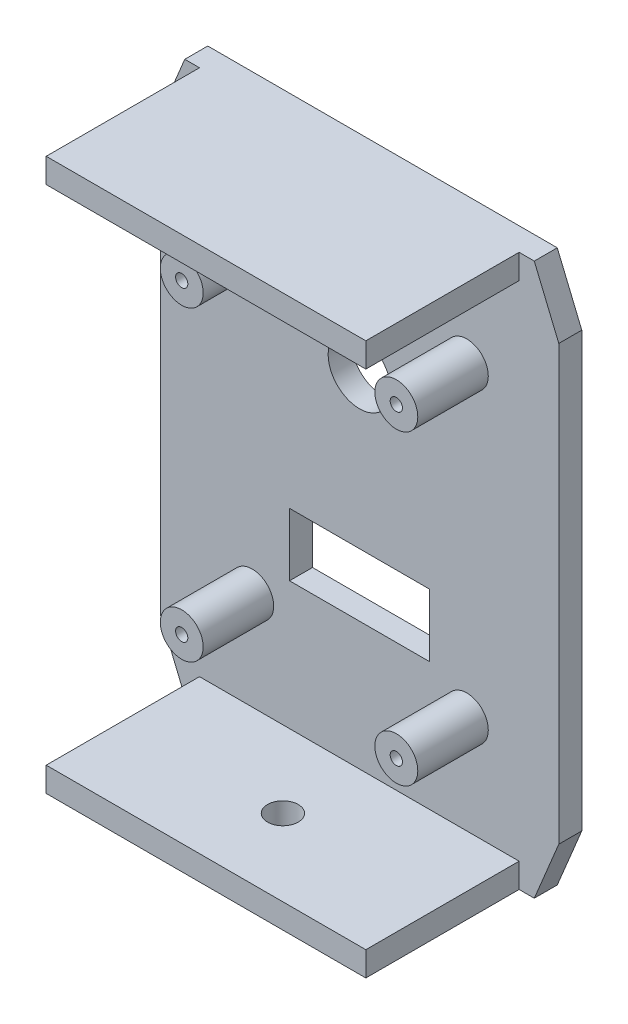
ISO-10303-21;
HEADER;
FILE_DESCRIPTION(('STEP AP214'),'2;1');
FILE_NAME('part.step','',(''),(''),'','','');
FILE_SCHEMA(('AUTOMOTIVE_DESIGN { 1 0 10303 214 1 1 1 1 }'));
ENDSEC;
DATA;
#1=APPLICATION_CONTEXT('core data for automotive mechanical design processes');
#2=APPLICATION_PROTOCOL_DEFINITION('international standard','automotive_design',2000,#1);
#3=PRODUCT_CONTEXT('',#1,'mechanical');
#4=PRODUCT('Part','Part','',(#3));
#5=PRODUCT_RELATED_PRODUCT_CATEGORY('part','',(#4));
#6=PRODUCT_DEFINITION_FORMATION('','',#4);
#7=PRODUCT_DEFINITION_CONTEXT('part definition',#1,'design');
#8=PRODUCT_DEFINITION('design','',#6,#7);
#9=PRODUCT_DEFINITION_SHAPE('','',#8);
#10=(LENGTH_UNIT() NAMED_UNIT(*) SI_UNIT(.MILLI.,.METRE.));
#11=(NAMED_UNIT(*) PLANE_ANGLE_UNIT() SI_UNIT($,.RADIAN.));
#12=(NAMED_UNIT(*) SI_UNIT($,.STERADIAN.) SOLID_ANGLE_UNIT());
#13=UNCERTAINTY_MEASURE_WITH_UNIT(LENGTH_MEASURE(1.E-05),#10,'distance_accuracy_value','');
#14=(GEOMETRIC_REPRESENTATION_CONTEXT(3) GLOBAL_UNCERTAINTY_ASSIGNED_CONTEXT((#13)) GLOBAL_UNIT_ASSIGNED_CONTEXT((#10,
#11,#12)) REPRESENTATION_CONTEXT('',''));
#15=CARTESIAN_POINT('',(0.,0.,0.));
#16=DIRECTION('',(0.,0.,1.));
#17=DIRECTION('',(1.,0.,0.));
#18=AXIS2_PLACEMENT_3D('',#15,#16,#17);
#19=CARTESIAN_POINT('',(0.,0.,4.7625));
#20=DIRECTION('',(0.,0.,1.));
#21=DIRECTION('',(1.,0.,0.));
#22=AXIS2_PLACEMENT_3D('',#19,#20,#21);
#23=PLANE('',#22);
#24=CARTESIAN_POINT('',(-33.2771901818714,22.9491818922137,4.7625));
#25=DIRECTION('',(0.,0.,1.));
#26=DIRECTION('',(1.,0.,0.));
#27=AXIS2_PLACEMENT_3D('',#24,#25,#26);
#28=CIRCLE('',#27,4.44499999999999);
#29=CARTESIAN_POINT('',(-28.8321901818714,22.9491818922137,4.7625));
#30=VERTEX_POINT('',#29);
#31=EDGE_CURVE('E543',#30,#30,#28,.T.);
#32=ORIENTED_EDGE('',*,*,#31,.F.);
#33=EDGE_LOOP('',(#32));
#34=FACE_BOUND('',#33,.T.);
#35=CARTESIAN_POINT('',(11.1728098181286,22.9491818922137,4.7625));
#36=DIRECTION('',(0.,0.,1.));
#37=DIRECTION('',(1.,0.,0.));
#38=AXIS2_PLACEMENT_3D('',#35,#36,#37);
#39=CIRCLE('',#38,4.445);
#40=CARTESIAN_POINT('',(15.6178098181286,22.9491818922137,4.7625));
#41=VERTEX_POINT('',#40);
#42=EDGE_CURVE('E547',#41,#41,#39,.T.);
#43=ORIENTED_EDGE('',*,*,#42,.F.);
#44=EDGE_LOOP('',(#43));
#45=FACE_BOUND('',#44,.T.);
#46=CARTESIAN_POINT('',(-33.2771901818714,-40.5508181077864,4.7625));
#47=DIRECTION('',(0.,0.,1.));
#48=DIRECTION('',(1.,0.,0.));
#49=AXIS2_PLACEMENT_3D('',#46,#47,#48);
#50=CIRCLE('',#49,4.445);
#51=CARTESIAN_POINT('',(-28.8321901818714,-40.5508181077864,4.7625));
#52=VERTEX_POINT('',#51);
#53=EDGE_CURVE('E553',#52,#52,#50,.T.);
#54=ORIENTED_EDGE('',*,*,#53,.F.);
#55=EDGE_LOOP('',(#54));
#56=FACE_BOUND('',#55,.T.);
#57=CARTESIAN_POINT('',(11.1728098181286,-40.5508181077864,4.7625));
#58=DIRECTION('',(0.,0.,1.));
#59=DIRECTION('',(1.,0.,0.));
#60=AXIS2_PLACEMENT_3D('',#57,#58,#59);
#61=CIRCLE('',#60,4.445);
#62=CARTESIAN_POINT('',(15.6178098181286,-40.5508181077864,4.7625));
#63=VERTEX_POINT('',#62);
#64=EDGE_CURVE('E559',#63,#63,#61,.T.);
#65=ORIENTED_EDGE('',*,*,#64,.F.);
#66=EDGE_LOOP('',(#65));
#67=FACE_BOUND('',#66,.T.);
#68=CARTESIAN_POINT('',(-11.0521901818713,10.2491818922136,4.7625));
#69=DIRECTION('',(0.,0.,-1.));
#70=DIRECTION('',(-1.,0.,0.));
#71=AXIS2_PLACEMENT_3D('',#68,#69,#70);
#72=CIRCLE('',#71,6.4999997);
#73=CARTESIAN_POINT('',(-17.5521898818713,10.2491818922136,4.7625));
#74=VERTEX_POINT('',#73);
#75=EDGE_CURVE('E203',#74,#74,#72,.T.);
#76=ORIENTED_EDGE('',*,*,#75,.T.);
#77=EDGE_LOOP('',(#76));
#78=FACE_BOUND('',#77,.T.);
#79=DIRECTION('',(0.,1.,0.));
#80=VECTOR('',#79,1.);
#81=CARTESIAN_POINT('',(-25.5521611818713,-21.3508184077864,4.7625));
#82=LINE('',#81,#80);
#83=CARTESIAN_POINT('',(-25.5521611818713,-34.3508178077864,4.7625));
#84=VERTEX_POINT('',#83);
#85=CARTESIAN_POINT('',(-25.5521611818713,-21.3508184077864,4.7625));
#86=VERTEX_POINT('',#85);
#87=EDGE_CURVE('E175',#84,#86,#82,.T.);
#88=ORIENTED_EDGE('',*,*,#87,.T.);
#89=DIRECTION('',(1.,0.,0.));
#90=VECTOR('',#89,1.);
#91=CARTESIAN_POINT('',(3.44778081812867,-21.3508184077864,4.7625));
#92=LINE('',#91,#90);
#93=CARTESIAN_POINT('',(3.44778081812867,-21.3508184077864,4.7625));
#94=VERTEX_POINT('',#93);
#95=EDGE_CURVE('E184',#86,#94,#92,.T.);
#96=ORIENTED_EDGE('',*,*,#95,.T.);
#97=DIRECTION('',(0.,-1.,0.));
#98=VECTOR('',#97,1.);
#99=CARTESIAN_POINT('',(3.44778081812867,-21.3508184077864,4.7625));
#100=LINE('',#99,#98);
#101=CARTESIAN_POINT('',(3.44778081812867,-34.3508178077864,4.7625));
#102=VERTEX_POINT('',#101);
#103=EDGE_CURVE('E52',#94,#102,#100,.T.);
#104=ORIENTED_EDGE('',*,*,#103,.T.);
#105=DIRECTION('',(-1.,0.,0.));
#106=VECTOR('',#105,1.);
#107=CARTESIAN_POINT('',(3.44778081812867,-34.3508178077864,4.7625));
#108=LINE('',#107,#106);
#109=EDGE_CURVE('E181',#102,#84,#108,.T.);
#110=ORIENTED_EDGE('',*,*,#109,.T.);
#111=EDGE_LOOP('',(#88,#96,#104,#110));
#112=FACE_BOUND('',#111,.T.);
#113=DIRECTION('',(1.,0.,0.));
#114=VECTOR('',#113,1.);
#115=CARTESIAN_POINT('',(0.,-65.9508181077864,4.7625));
#116=LINE('',#115,#114);
#117=CARTESIAN_POINT('',(-47.2471901818713,-65.9508181077864,4.7625));
#118=VERTEX_POINT('',#117);
#119=CARTESIAN_POINT('',(-44.1991901818713,-65.9508181077865,4.7625));
#120=VERTEX_POINT('',#119);
#121=EDGE_CURVE('E274',#118,#120,#116,.T.);
#122=ORIENTED_EDGE('',*,*,#121,.T.);
#123=DIRECTION('',(0.,-1.,0.));
#124=VECTOR('',#123,1.);
#125=CARTESIAN_POINT('',(-44.1991901818713,-60.8709997598715,4.7625));
#126=LINE('',#125,#124);
#127=CARTESIAN_POINT('',(-44.1991901818713,-60.8709997598715,4.7625));
#128=VERTEX_POINT('',#127);
#129=EDGE_CURVE('E226',#128,#120,#126,.T.);
#130=ORIENTED_EDGE('',*,*,#129,.F.);
#131=DIRECTION('',(-1.,0.,0.));
#132=VECTOR('',#131,1.);
#133=CARTESIAN_POINT('',(-44.1991901818713,-60.8709997598715,4.7625));
#134=LINE('',#133,#132);
#135=CARTESIAN_POINT('',(22.0016687501231,-60.8709997598715,4.7625));
#136=VERTEX_POINT('',#135);
#137=EDGE_CURVE('E209',#136,#128,#134,.T.);
#138=ORIENTED_EDGE('',*,*,#137,.F.);
#139=DIRECTION('',(0.,1.,0.));
#140=VECTOR('',#139,1.);
#141=CARTESIAN_POINT('',(22.0016687501231,-60.8709997598715,4.7625));
#142=LINE('',#141,#140);
#143=CARTESIAN_POINT('',(22.0016687501231,-65.9508181077864,4.7625));
#144=VERTEX_POINT('',#143);
#145=EDGE_CURVE('E217',#144,#136,#142,.T.);
#146=ORIENTED_EDGE('',*,*,#145,.F.);
#147=CARTESIAN_POINT('',(25.1428098181287,-65.9508181077864,4.7625));
#148=VERTEX_POINT('',#147);
#149=EDGE_CURVE('E272',#144,#148,#116,.T.);
#150=ORIENTED_EDGE('',*,*,#149,.T.);
#151=DIRECTION('',(0.383447283100766,0.923562765101886,0.));
#152=VECTOR('',#151,1.);
#153=CARTESIAN_POINT('',(44.8016833803675,-18.6008839027281,4.7625));
#154=LINE('',#153,#152);
#155=CARTESIAN_POINT('',(30.2228098181286,-53.7152408759492,4.7625));
#156=VERTEX_POINT('',#155);
#157=EDGE_CURVE('E277',#148,#156,#154,.T.);
#158=ORIENTED_EDGE('',*,*,#157,.T.);
#159=DIRECTION('',(0.,-1.,0.));
#160=VECTOR('',#159,1.);
#161=CARTESIAN_POINT('',(30.2228098181286,0.,4.7625));
#162=LINE('',#161,#160);
#163=CARTESIAN_POINT('',(30.2228098181286,36.1136046603764,4.7625));
#164=VERTEX_POINT('',#163);
#165=EDGE_CURVE('E279',#164,#156,#162,.T.);
#166=ORIENTED_EDGE('',*,*,#165,.F.);
#167=DIRECTION('',(0.383447283100766,-0.923562765101886,0.));
#168=VECTOR('',#167,1.);
#169=CARTESIAN_POINT('',(38.5682815931536,16.0128833140307,4.7625));
#170=LINE('',#169,#168);
#171=CARTESIAN_POINT('',(25.1428098181286,48.3491818922136,4.7625));
#172=VERTEX_POINT('',#171);
#173=EDGE_CURVE('E282',#172,#164,#170,.T.);
#174=ORIENTED_EDGE('',*,*,#173,.F.);
#175=DIRECTION('',(1.,0.,0.));
#176=VECTOR('',#175,1.);
#177=CARTESIAN_POINT('',(0.,48.3491818922136,4.7625));
#178=LINE('',#177,#176);
#179=CARTESIAN_POINT('',(22.0016687501231,48.3491818922136,4.7625));
#180=VERTEX_POINT('',#179);
#181=EDGE_CURVE('E285',#180,#172,#178,.T.);
#182=ORIENTED_EDGE('',*,*,#181,.F.);
#183=DIRECTION('',(0.,1.,0.));
#184=VECTOR('',#183,1.);
#185=CARTESIAN_POINT('',(22.0016687501231,43.2693635442985,4.7625));
#186=LINE('',#185,#184);
#187=CARTESIAN_POINT('',(22.0016687501231,43.2693635442985,4.7625));
#188=VERTEX_POINT('',#187);
#189=EDGE_CURVE('E243',#188,#180,#186,.T.);
#190=ORIENTED_EDGE('',*,*,#189,.F.);
#191=DIRECTION('',(1.,0.,0.));
#192=VECTOR('',#191,1.);
#193=CARTESIAN_POINT('',(-44.1991901818713,43.2693635442985,4.7625));
#194=LINE('',#193,#192);
#195=CARTESIAN_POINT('',(-44.1991901818713,43.2693635442985,4.7625));
#196=VERTEX_POINT('',#195);
#197=EDGE_CURVE('E252',#196,#188,#194,.T.);
#198=ORIENTED_EDGE('',*,*,#197,.F.);
#199=DIRECTION('',(0.,-1.,0.));
#200=VECTOR('',#199,1.);
#201=CARTESIAN_POINT('',(-44.1991901818713,43.2693635442985,4.7625));
#202=LINE('',#201,#200);
#203=CARTESIAN_POINT('',(-44.1991901818713,48.3491818922136,4.7625));
#204=VERTEX_POINT('',#203);
#205=EDGE_CURVE('E238',#204,#196,#202,.T.);
#206=ORIENTED_EDGE('',*,*,#205,.F.);
#207=CARTESIAN_POINT('',(-47.2471901818713,48.3491818922136,4.7625));
#208=VERTEX_POINT('',#207);
#209=EDGE_CURVE('E286',#208,#204,#178,.T.);
#210=ORIENTED_EDGE('',*,*,#209,.F.);
#211=DIRECTION('',(-0.383447283100767,-0.923562765101886,0.));
#212=VECTOR('',#211,1.);
#213=CARTESIAN_POINT('',(-57.4226147059741,23.8408762561133,4.7625));
#214=LINE('',#213,#212);
#215=CARTESIAN_POINT('',(-52.3271901818714,36.1136046603762,4.7625));
#216=VERTEX_POINT('',#215);
#217=EDGE_CURVE('E289',#208,#216,#214,.T.);
#218=ORIENTED_EDGE('',*,*,#217,.T.);
#219=DIRECTION('',(0.,-1.,0.));
#220=VECTOR('',#219,1.);
#221=CARTESIAN_POINT('',(-52.3271901818714,0.,4.7625));
#222=LINE('',#221,#220);
#223=CARTESIAN_POINT('',(-52.3271901818714,-53.7152408759491,4.7625));
#224=VERTEX_POINT('',#223);
#225=EDGE_CURVE('E291',#216,#224,#222,.T.);
#226=ORIENTED_EDGE('',*,*,#225,.T.);
#227=DIRECTION('',(-0.383447283100767,0.923562765101886,0.));
#228=VECTOR('',#227,1.);
#229=CARTESIAN_POINT('',(-63.6560164931879,-26.4288768448106,4.7625));
#230=LINE('',#229,#228);
#231=EDGE_CURVE('E269',#118,#224,#230,.T.);
#232=ORIENTED_EDGE('',*,*,#231,.F.);
#233=EDGE_LOOP('',(#122,#130,#138,#146,#150,#158,#166,#174,#182,#190,#198,#206,#210,#218,#226,#232));
#234=FACE_BOUND('',#233,.T.);
#235=ADVANCED_FACE('F36',(#34,#45,#56,#67,#78,#112,#234),#23,.T.);
#236=CARTESIAN_POINT('',(-63.6560164931879,-26.4288768448106,4.7625));
#237=DIRECTION('',(-0.923562765101886,-0.383447283100766,0.));
#238=DIRECTION('',(0.383447283100767,-0.923562765101886,0.));
#239=AXIS2_PLACEMENT_3D('',#236,#237,#238);
#240=PLANE('',#239);
#241=DIRECTION('',(-0.383447283100767,0.923562765101886,0.));
#242=VECTOR('',#241,1.);
#243=CARTESIAN_POINT('',(-63.6560164931879,-26.4288768448106,0.));
#244=LINE('',#243,#242);
#245=CARTESIAN_POINT('',(-47.2471901818713,-65.9508181077864,0.));
#246=VERTEX_POINT('',#245);
#247=CARTESIAN_POINT('',(-52.3271901818714,-53.7152408759491,0.));
#248=VERTEX_POINT('',#247);
#249=EDGE_CURVE('E268',#246,#248,#244,.T.);
#250=ORIENTED_EDGE('',*,*,#249,.F.);
#251=DIRECTION('',(0.,0.,-1.));
#252=VECTOR('',#251,1.);
#253=CARTESIAN_POINT('',(-47.2471901818713,-65.9508181077864,4.7625));
#254=LINE('',#253,#252);
#255=EDGE_CURVE('E11',#118,#246,#254,.T.);
#256=ORIENTED_EDGE('',*,*,#255,.F.);
#257=ORIENTED_EDGE('',*,*,#231,.T.);
#258=DIRECTION('',(0.,0.,-1.));
#259=VECTOR('',#258,1.);
#260=CARTESIAN_POINT('',(-52.3271901818714,-53.7152408759491,4.7625));
#261=LINE('',#260,#259);
#262=EDGE_CURVE('E293',#224,#248,#261,.T.);
#263=ORIENTED_EDGE('',*,*,#262,.T.);
#264=EDGE_LOOP('',(#250,#256,#257,#263));
#265=FACE_BOUND('',#264,.T.);
#266=ADVANCED_FACE('F38',(#265),#240,.T.);
#267=CARTESIAN_POINT('',(0.,-65.9508181077864,4.7625));
#268=DIRECTION('',(0.,1.,0.));
#269=DIRECTION('',(0.,0.,1.));
#270=AXIS2_PLACEMENT_3D('',#267,#268,#269);
#271=PLANE('',#270);
#272=CARTESIAN_POINT('',(-11.0521901818713,-65.9508181077864,20.6375));
#273=DIRECTION('',(0.,-1.,0.));
#274=DIRECTION('',(0.,0.,-1.));
#275=AXIS2_PLACEMENT_3D('',#272,#273,#274);
#276=CIRCLE('',#275,3.175);
#277=CARTESIAN_POINT('',(-11.0521901818713,-65.9508181077864,17.4625));
#278=VERTEX_POINT('',#277);
#279=EDGE_CURVE('E416',#278,#278,#276,.T.);
#280=ORIENTED_EDGE('',*,*,#279,.F.);
#281=EDGE_LOOP('',(#280));
#282=FACE_BOUND('',#281,.T.);
#283=DIRECTION('',(1.,0.,0.));
#284=VECTOR('',#283,1.);
#285=CARTESIAN_POINT('',(0.,-65.9508181077864,0.));
#286=LINE('',#285,#284);
#287=CARTESIAN_POINT('',(25.1428098181287,-65.9508181077864,0.));
#288=VERTEX_POINT('',#287);
#289=EDGE_CURVE('E296',#246,#288,#286,.T.);
#290=ORIENTED_EDGE('',*,*,#289,.T.);
#291=DIRECTION('',(0.,0.,-1.));
#292=VECTOR('',#291,1.);
#293=CARTESIAN_POINT('',(25.1428098181287,-65.9508181077864,4.7625));
#294=LINE('',#293,#292);
#295=EDGE_CURVE('E45',#148,#288,#294,.T.);
#296=ORIENTED_EDGE('',*,*,#295,.F.);
#297=ORIENTED_EDGE('',*,*,#149,.F.);
#298=DIRECTION('',(0.,0.,-1.));
#299=VECTOR('',#298,1.);
#300=CARTESIAN_POINT('',(22.0016687501231,-65.9508181077865,36.5125));
#301=LINE('',#300,#299);
#302=CARTESIAN_POINT('',(22.0016687501231,-65.9508181077865,36.5125));
#303=VERTEX_POINT('',#302);
#304=EDGE_CURVE('E231',#303,#144,#301,.T.);
#305=ORIENTED_EDGE('',*,*,#304,.F.);
#306=DIRECTION('',(1.,0.,0.));
#307=VECTOR('',#306,1.);
#308=CARTESIAN_POINT('',(-44.1991901818713,-65.9508181077865,36.5125));
#309=LINE('',#308,#307);
#310=CARTESIAN_POINT('',(-44.1991901818713,-65.9508181077865,36.5125));
#311=VERTEX_POINT('',#310);
#312=EDGE_CURVE('E219',#311,#303,#309,.T.);
#313=ORIENTED_EDGE('',*,*,#312,.F.);
#314=DIRECTION('',(0.,0.,-1.));
#315=VECTOR('',#314,1.);
#316=CARTESIAN_POINT('',(-44.1991901818713,-65.9508181077865,36.5125));
#317=LINE('',#316,#315);
#318=EDGE_CURVE('E233',#311,#120,#317,.T.);
#319=ORIENTED_EDGE('',*,*,#318,.T.);
#320=ORIENTED_EDGE('',*,*,#121,.F.);
#321=ORIENTED_EDGE('',*,*,#255,.T.);
#322=EDGE_LOOP('',(#290,#296,#297,#305,#313,#319,#320,#321));
#323=FACE_BOUND('',#322,.T.);
#324=ADVANCED_FACE('F385',(#282,#323),#271,.F.);
#325=CARTESIAN_POINT('',(44.8016833803675,-18.6008839027281,4.7625));
#326=DIRECTION('',(-0.923562765101886,0.383447283100766,0.));
#327=DIRECTION('',(-0.383447283100766,-0.923562765101886,0.));
#328=AXIS2_PLACEMENT_3D('',#325,#326,#327);
#329=PLANE('',#328);
#330=DIRECTION('',(0.383447283100766,0.923562765101886,0.));
#331=VECTOR('',#330,1.);
#332=CARTESIAN_POINT('',(44.8016833803675,-18.6008839027281,0.));
#333=LINE('',#332,#331);
#334=CARTESIAN_POINT('',(30.2228098181286,-53.7152408759492,0.));
#335=VERTEX_POINT('',#334);
#336=EDGE_CURVE('E298',#288,#335,#333,.T.);
#337=ORIENTED_EDGE('',*,*,#336,.T.);
#338=DIRECTION('',(0.,0.,-1.));
#339=VECTOR('',#338,1.);
#340=CARTESIAN_POINT('',(30.2228098181286,-53.7152408759492,4.7625));
#341=LINE('',#340,#339);
#342=EDGE_CURVE('E324',#156,#335,#341,.T.);
#343=ORIENTED_EDGE('',*,*,#342,.F.);
#344=ORIENTED_EDGE('',*,*,#157,.F.);
#345=ORIENTED_EDGE('',*,*,#295,.T.);
#346=EDGE_LOOP('',(#337,#343,#344,#345));
#347=FACE_BOUND('',#346,.T.);
#348=ADVANCED_FACE('F331',(#347),#329,.F.);
#349=CARTESIAN_POINT('',(30.2228098181286,0.,4.7625));
#350=DIRECTION('',(1.,0.,0.));
#351=DIRECTION('',(0.,1.,0.));
#352=AXIS2_PLACEMENT_3D('',#349,#350,#351);
#353=PLANE('',#352);
#354=DIRECTION('',(0.,-1.,0.));
#355=VECTOR('',#354,1.);
#356=CARTESIAN_POINT('',(30.2228098181286,0.,0.));
#357=LINE('',#356,#355);
#358=CARTESIAN_POINT('',(30.2228098181286,36.1136046603764,0.));
#359=VERTEX_POINT('',#358);
#360=EDGE_CURVE('E301',#359,#335,#357,.T.);
#361=ORIENTED_EDGE('',*,*,#360,.F.);
#362=DIRECTION('',(0.,0.,-1.));
#363=VECTOR('',#362,1.);
#364=CARTESIAN_POINT('',(30.2228098181286,36.1136046603764,4.7625));
#365=LINE('',#364,#363);
#366=EDGE_CURVE('E322',#164,#359,#365,.T.);
#367=ORIENTED_EDGE('',*,*,#366,.F.);
#368=ORIENTED_EDGE('',*,*,#165,.T.);
#369=ORIENTED_EDGE('',*,*,#342,.T.);
#370=EDGE_LOOP('',(#361,#367,#368,#369));
#371=FACE_BOUND('',#370,.T.);
#372=ADVANCED_FACE('F342',(#371),#353,.T.);
#373=CARTESIAN_POINT('',(38.5682815931536,16.0128833140307,4.7625));
#374=DIRECTION('',(0.923562765101886,0.383447283100766,0.));
#375=DIRECTION('',(-0.383447283100766,0.923562765101886,0.));
#376=AXIS2_PLACEMENT_3D('',#373,#374,#375);
#377=PLANE('',#376);
#378=DIRECTION('',(0.383447283100766,-0.923562765101886,0.));
#379=VECTOR('',#378,1.);
#380=CARTESIAN_POINT('',(38.5682815931536,16.0128833140307,0.));
#381=LINE('',#380,#379);
#382=CARTESIAN_POINT('',(25.1428098181286,48.3491818922136,0.));
#383=VERTEX_POINT('',#382);
#384=EDGE_CURVE('E304',#383,#359,#381,.T.);
#385=ORIENTED_EDGE('',*,*,#384,.F.);
#386=DIRECTION('',(0.,0.,-1.));
#387=VECTOR('',#386,1.);
#388=CARTESIAN_POINT('',(25.1428098181286,48.3491818922136,4.7625));
#389=LINE('',#388,#387);
#390=EDGE_CURVE('E320',#172,#383,#389,.T.);
#391=ORIENTED_EDGE('',*,*,#390,.F.);
#392=ORIENTED_EDGE('',*,*,#173,.T.);
#393=ORIENTED_EDGE('',*,*,#366,.T.);
#394=EDGE_LOOP('',(#385,#391,#392,#393));
#395=FACE_BOUND('',#394,.T.);
#396=ADVANCED_FACE('F347',(#395),#377,.T.);
#397=CARTESIAN_POINT('',(0.,48.3491818922136,4.7625));
#398=DIRECTION('',(0.,1.,0.));
#399=DIRECTION('',(0.,0.,1.));
#400=AXIS2_PLACEMENT_3D('',#397,#398,#399);
#401=PLANE('',#400);
#402=DIRECTION('',(1.,0.,0.));
#403=VECTOR('',#402,1.);
#404=CARTESIAN_POINT('',(0.,48.3491818922136,0.));
#405=LINE('',#404,#403);
#406=CARTESIAN_POINT('',(-47.2471901818713,48.3491818922136,0.));
#407=VERTEX_POINT('',#406);
#408=EDGE_CURVE('E307',#407,#383,#405,.T.);
#409=ORIENTED_EDGE('',*,*,#408,.F.);
#410=DIRECTION('',(0.,0.,-1.));
#411=VECTOR('',#410,1.);
#412=CARTESIAN_POINT('',(-47.2471901818713,48.3491818922136,4.7625));
#413=LINE('',#412,#411);
#414=EDGE_CURVE('E318',#208,#407,#413,.T.);
#415=ORIENTED_EDGE('',*,*,#414,.F.);
#416=ORIENTED_EDGE('',*,*,#209,.T.);
#417=DIRECTION('',(0.,0.,-1.));
#418=VECTOR('',#417,1.);
#419=CARTESIAN_POINT('',(-44.1991901818713,48.3491818922136,36.5125));
#420=LINE('',#419,#418);
#421=CARTESIAN_POINT('',(-44.1991901818713,48.3491818922136,36.5125));
#422=VERTEX_POINT('',#421);
#423=EDGE_CURVE('E249',#422,#204,#420,.T.);
#424=ORIENTED_EDGE('',*,*,#423,.F.);
#425=DIRECTION('',(-1.,0.,0.));
#426=VECTOR('',#425,1.);
#427=CARTESIAN_POINT('',(-44.1991901818713,48.3491818922136,36.5125));
#428=LINE('',#427,#426);
#429=CARTESIAN_POINT('',(22.0016687501231,48.3491818922136,36.5125));
#430=VERTEX_POINT('',#429);
#431=EDGE_CURVE('E247',#430,#422,#428,.T.);
#432=ORIENTED_EDGE('',*,*,#431,.F.);
#433=DIRECTION('',(0.,0.,-1.));
#434=VECTOR('',#433,1.);
#435=CARTESIAN_POINT('',(22.0016687501231,48.3491818922136,36.5125));
#436=LINE('',#435,#434);
#437=EDGE_CURVE('E259',#430,#180,#436,.T.);
#438=ORIENTED_EDGE('',*,*,#437,.T.);
#439=ORIENTED_EDGE('',*,*,#181,.T.);
#440=ORIENTED_EDGE('',*,*,#390,.T.);
#441=EDGE_LOOP('',(#409,#415,#416,#424,#432,#438,#439,#440));
#442=FACE_BOUND('',#441,.T.);
#443=ADVANCED_FACE('F350',(#442),#401,.T.);
#444=CARTESIAN_POINT('',(-57.4226147059741,23.8408762561133,4.7625));
#445=DIRECTION('',(0.923562765101886,-0.383447283100766,0.));
#446=DIRECTION('',(0.383447283100767,0.923562765101886,0.));
#447=AXIS2_PLACEMENT_3D('',#444,#445,#446);
#448=PLANE('',#447);
#449=DIRECTION('',(-0.383447283100767,-0.923562765101886,0.));
#450=VECTOR('',#449,1.);
#451=CARTESIAN_POINT('',(-57.4226147059741,23.8408762561133,0.));
#452=LINE('',#451,#450);
#453=CARTESIAN_POINT('',(-52.3271901818714,36.1136046603762,0.));
#454=VERTEX_POINT('',#453);
#455=EDGE_CURVE('E310',#407,#454,#452,.T.);
#456=ORIENTED_EDGE('',*,*,#455,.T.);
#457=DIRECTION('',(0.,0.,-1.));
#458=VECTOR('',#457,1.);
#459=CARTESIAN_POINT('',(-52.3271901818714,36.1136046603762,4.7625));
#460=LINE('',#459,#458);
#461=EDGE_CURVE('E315',#216,#454,#460,.T.);
#462=ORIENTED_EDGE('',*,*,#461,.F.);
#463=ORIENTED_EDGE('',*,*,#217,.F.);
#464=ORIENTED_EDGE('',*,*,#414,.T.);
#465=EDGE_LOOP('',(#456,#462,#463,#464));
#466=FACE_BOUND('',#465,.T.);
#467=ADVANCED_FACE('F398',(#466),#448,.F.);
#468=CARTESIAN_POINT('',(-52.3271901818714,0.,4.7625));
#469=DIRECTION('',(1.,0.,0.));
#470=DIRECTION('',(0.,1.,0.));
#471=AXIS2_PLACEMENT_3D('',#468,#469,#470);
#472=PLANE('',#471);
#473=DIRECTION('',(0.,-1.,0.));
#474=VECTOR('',#473,1.);
#475=CARTESIAN_POINT('',(-52.3271901818714,0.,0.));
#476=LINE('',#475,#474);
#477=EDGE_CURVE('E273',#454,#248,#476,.T.);
#478=ORIENTED_EDGE('',*,*,#477,.T.);
#479=ORIENTED_EDGE('',*,*,#262,.F.);
#480=ORIENTED_EDGE('',*,*,#225,.F.);
#481=ORIENTED_EDGE('',*,*,#461,.T.);
#482=EDGE_LOOP('',(#478,#479,#480,#481));
#483=FACE_BOUND('',#482,.T.);
#484=ADVANCED_FACE('F394',(#483),#472,.F.);
#485=CARTESIAN_POINT('',(0.,0.,0.));
#486=DIRECTION('',(0.,0.,1.));
#487=DIRECTION('',(1.,0.,0.));
#488=AXIS2_PLACEMENT_3D('',#485,#486,#487);
#489=PLANE('',#488);
#490=CARTESIAN_POINT('',(11.1728098181286,22.9491818922137,0.));
#491=DIRECTION('',(0.,0.,1.));
#492=DIRECTION('',(1.,0.,0.));
#493=AXIS2_PLACEMENT_3D('',#490,#491,#492);
#494=CIRCLE('',#493,1.27);
#495=CARTESIAN_POINT('',(12.4428098181286,22.9491818922137,0.));
#496=VERTEX_POINT('',#495);
#497=EDGE_CURVE('E523',#496,#496,#494,.T.);
#498=ORIENTED_EDGE('',*,*,#497,.T.);
#499=EDGE_LOOP('',(#498));
#500=FACE_BOUND('',#499,.T.);
#501=CARTESIAN_POINT('',(11.1728098181286,-40.5508181077864,0.));
#502=DIRECTION('',(0.,0.,1.));
#503=DIRECTION('',(1.,0.,0.));
#504=AXIS2_PLACEMENT_3D('',#501,#502,#503);
#505=CIRCLE('',#504,1.27);
#506=CARTESIAN_POINT('',(12.4428098181286,-40.5508181077864,0.));
#507=VERTEX_POINT('',#506);
#508=EDGE_CURVE('E527',#507,#507,#505,.T.);
#509=ORIENTED_EDGE('',*,*,#508,.T.);
#510=EDGE_LOOP('',(#509));
#511=FACE_BOUND('',#510,.T.);
#512=CARTESIAN_POINT('',(-33.2771901818714,-40.5508181077864,0.));
#513=DIRECTION('',(0.,0.,1.));
#514=DIRECTION('',(1.,0.,0.));
#515=AXIS2_PLACEMENT_3D('',#512,#513,#514);
#516=CIRCLE('',#515,1.27);
#517=CARTESIAN_POINT('',(-32.0071901818714,-40.5508181077864,0.));
#518=VERTEX_POINT('',#517);
#519=EDGE_CURVE('E524',#518,#518,#516,.T.);
#520=ORIENTED_EDGE('',*,*,#519,.T.);
#521=EDGE_LOOP('',(#520));
#522=FACE_BOUND('',#521,.T.);
#523=CARTESIAN_POINT('',(-33.2771901818714,22.9491818922137,0.));
#524=DIRECTION('',(0.,0.,1.));
#525=DIRECTION('',(1.,0.,0.));
#526=AXIS2_PLACEMENT_3D('',#523,#524,#525);
#527=CIRCLE('',#526,1.27);
#528=CARTESIAN_POINT('',(-32.0071901818714,22.9491818922137,0.));
#529=VERTEX_POINT('',#528);
#530=EDGE_CURVE('E540',#529,#529,#527,.T.);
#531=ORIENTED_EDGE('',*,*,#530,.T.);
#532=EDGE_LOOP('',(#531));
#533=FACE_BOUND('',#532,.T.);
#534=CARTESIAN_POINT('',(-11.0521901818713,10.2491818922136,0.));
#535=DIRECTION('',(0.,0.,-1.));
#536=DIRECTION('',(-1.,0.,0.));
#537=AXIS2_PLACEMENT_3D('',#534,#535,#536);
#538=CIRCLE('',#537,6.4999997);
#539=CARTESIAN_POINT('',(-17.5521898818713,10.2491818922136,0.));
#540=VERTEX_POINT('',#539);
#541=EDGE_CURVE('E196',#540,#540,#538,.T.);
#542=ORIENTED_EDGE('',*,*,#541,.F.);
#543=EDGE_LOOP('',(#542));
#544=FACE_BOUND('',#543,.T.);
#545=DIRECTION('',(1.,0.,0.));
#546=VECTOR('',#545,1.);
#547=CARTESIAN_POINT('',(3.44778081812867,-21.3508184077864,0.));
#548=LINE('',#547,#546);
#549=CARTESIAN_POINT('',(-25.5521611818713,-21.3508184077864,0.));
#550=VERTEX_POINT('',#549);
#551=CARTESIAN_POINT('',(3.44778081812867,-21.3508184077864,0.));
#552=VERTEX_POINT('',#551);
#553=EDGE_CURVE('E202',#550,#552,#548,.T.);
#554=ORIENTED_EDGE('',*,*,#553,.F.);
#555=DIRECTION('',(0.,1.,0.));
#556=VECTOR('',#555,1.);
#557=CARTESIAN_POINT('',(-25.5521611818713,-21.3508184077864,0.));
#558=LINE('',#557,#556);
#559=CARTESIAN_POINT('',(-25.5521611818713,-34.3508178077864,0.));
#560=VERTEX_POINT('',#559);
#561=EDGE_CURVE('E60',#560,#550,#558,.T.);
#562=ORIENTED_EDGE('',*,*,#561,.F.);
#563=DIRECTION('',(-1.,0.,0.));
#564=VECTOR('',#563,1.);
#565=CARTESIAN_POINT('',(3.44778081812867,-34.3508178077864,0.));
#566=LINE('',#565,#564);
#567=CARTESIAN_POINT('',(3.44778081812867,-34.3508178077864,0.));
#568=VERTEX_POINT('',#567);
#569=EDGE_CURVE('E190',#568,#560,#566,.T.);
#570=ORIENTED_EDGE('',*,*,#569,.F.);
#571=DIRECTION('',(0.,-1.,0.));
#572=VECTOR('',#571,1.);
#573=CARTESIAN_POINT('',(3.44778081812867,-21.3508184077864,0.));
#574=LINE('',#573,#572);
#575=EDGE_CURVE('E193',#552,#568,#574,.T.);
#576=ORIENTED_EDGE('',*,*,#575,.F.);
#577=EDGE_LOOP('',(#554,#562,#570,#576));
#578=FACE_BOUND('',#577,.T.);
#579=ORIENTED_EDGE('',*,*,#249,.T.);
#580=ORIENTED_EDGE('',*,*,#477,.F.);
#581=ORIENTED_EDGE('',*,*,#455,.F.);
#582=ORIENTED_EDGE('',*,*,#408,.T.);
#583=ORIENTED_EDGE('',*,*,#384,.T.);
#584=ORIENTED_EDGE('',*,*,#360,.T.);
#585=ORIENTED_EDGE('',*,*,#336,.F.);
#586=ORIENTED_EDGE('',*,*,#289,.F.);
#587=EDGE_LOOP('',(#579,#580,#581,#582,#583,#584,#585,#586));
#588=FACE_BOUND('',#587,.T.);
#589=ADVANCED_FACE('F337',(#500,#511,#522,#533,#544,#578,#588),#489,.F.);
#590=CARTESIAN_POINT('',(-44.1991901818713,43.2693635442985,36.5125));
#591=DIRECTION('',(1.,0.,0.));
#592=DIRECTION('',(0.,0.,-1.));
#593=AXIS2_PLACEMENT_3D('',#590,#591,#592);
#594=PLANE('',#593);
#595=ORIENTED_EDGE('',*,*,#205,.T.);
#596=DIRECTION('',(0.,0.,-1.));
#597=VECTOR('',#596,1.);
#598=CARTESIAN_POINT('',(-44.1991901818713,43.2693635442985,36.5125));
#599=LINE('',#598,#597);
#600=CARTESIAN_POINT('',(-44.1991901818713,43.2693635442985,36.5125));
#601=VERTEX_POINT('',#600);
#602=EDGE_CURVE('E265',#601,#196,#599,.T.);
#603=ORIENTED_EDGE('',*,*,#602,.F.);
#604=DIRECTION('',(0.,-1.,0.));
#605=VECTOR('',#604,1.);
#606=CARTESIAN_POINT('',(-44.1991901818713,43.2693635442985,36.5125));
#607=LINE('',#606,#605);
#608=EDGE_CURVE('E239',#422,#601,#607,.T.);
#609=ORIENTED_EDGE('',*,*,#608,.F.);
#610=ORIENTED_EDGE('',*,*,#423,.T.);
#611=EDGE_LOOP('',(#595,#603,#609,#610));
#612=FACE_BOUND('',#611,.T.);
#613=ADVANCED_FACE('F365',(#612),#594,.F.);
#614=CARTESIAN_POINT('',(-44.1991901818713,43.2693635442985,36.5125));
#615=DIRECTION('',(0.,1.,0.));
#616=DIRECTION('',(0.,0.,1.));
#617=AXIS2_PLACEMENT_3D('',#614,#615,#616);
#618=PLANE('',#617);
#619=ORIENTED_EDGE('',*,*,#197,.T.);
#620=DIRECTION('',(0.,0.,-1.));
#621=VECTOR('',#620,1.);
#622=CARTESIAN_POINT('',(22.0016687501231,43.2693635442985,36.5125));
#623=LINE('',#622,#621);
#624=CARTESIAN_POINT('',(22.0016687501231,43.2693635442985,36.5125));
#625=VERTEX_POINT('',#624);
#626=EDGE_CURVE('E262',#625,#188,#623,.T.);
#627=ORIENTED_EDGE('',*,*,#626,.F.);
#628=DIRECTION('',(1.,0.,0.));
#629=VECTOR('',#628,1.);
#630=CARTESIAN_POINT('',(-44.1991901818713,43.2693635442985,36.5125));
#631=LINE('',#630,#629);
#632=EDGE_CURVE('E242',#601,#625,#631,.T.);
#633=ORIENTED_EDGE('',*,*,#632,.F.);
#634=ORIENTED_EDGE('',*,*,#602,.T.);
#635=EDGE_LOOP('',(#619,#627,#633,#634));
#636=FACE_BOUND('',#635,.T.);
#637=ADVANCED_FACE('F358',(#636),#618,.F.);
#638=CARTESIAN_POINT('',(22.0016687501231,43.2693635442985,36.5125));
#639=DIRECTION('',(-1.,0.,0.));
#640=DIRECTION('',(0.,0.,1.));
#641=AXIS2_PLACEMENT_3D('',#638,#639,#640);
#642=PLANE('',#641);
#643=ORIENTED_EDGE('',*,*,#189,.T.);
#644=ORIENTED_EDGE('',*,*,#437,.F.);
#645=DIRECTION('',(0.,1.,0.));
#646=VECTOR('',#645,1.);
#647=CARTESIAN_POINT('',(22.0016687501231,43.2693635442985,36.5125));
#648=LINE('',#647,#646);
#649=EDGE_CURVE('E245',#625,#430,#648,.T.);
#650=ORIENTED_EDGE('',*,*,#649,.F.);
#651=ORIENTED_EDGE('',*,*,#626,.T.);
#652=EDGE_LOOP('',(#643,#644,#650,#651));
#653=FACE_BOUND('',#652,.T.);
#654=ADVANCED_FACE('F354',(#653),#642,.F.);
#655=CARTESIAN_POINT('',(0.,0.,36.5125));
#656=DIRECTION('',(0.,0.,-1.));
#657=DIRECTION('',(-1.,0.,0.));
#658=AXIS2_PLACEMENT_3D('',#655,#656,#657);
#659=PLANE('',#658);
#660=ORIENTED_EDGE('',*,*,#608,.T.);
#661=ORIENTED_EDGE('',*,*,#632,.T.);
#662=ORIENTED_EDGE('',*,*,#649,.T.);
#663=ORIENTED_EDGE('',*,*,#431,.T.);
#664=EDGE_LOOP('',(#660,#661,#662,#663));
#665=FACE_BOUND('',#664,.T.);
#666=ADVANCED_FACE('F367',(#665),#659,.F.);
#667=CARTESIAN_POINT('',(-44.1991901818713,-60.8709997598715,36.5125));
#668=DIRECTION('',(0.,-1.,0.));
#669=DIRECTION('',(0.,0.,-1.));
#670=AXIS2_PLACEMENT_3D('',#667,#668,#669);
#671=PLANE('',#670);
#672=CARTESIAN_POINT('',(-11.0521901818713,-60.8709997598715,20.6375));
#673=DIRECTION('',(0.,-1.,0.));
#674=DIRECTION('',(0.,0.,-1.));
#675=AXIS2_PLACEMENT_3D('',#672,#673,#674);
#676=CIRCLE('',#675,3.175);
#677=CARTESIAN_POINT('',(-11.0521901818713,-60.8709997598715,17.4625));
#678=VERTEX_POINT('',#677);
#679=EDGE_CURVE('E40',#678,#678,#676,.T.);
#680=ORIENTED_EDGE('',*,*,#679,.T.);
#681=EDGE_LOOP('',(#680));
#682=FACE_BOUND('',#681,.T.);
#683=ORIENTED_EDGE('',*,*,#137,.T.);
#684=DIRECTION('',(0.,0.,-1.));
#685=VECTOR('',#684,1.);
#686=CARTESIAN_POINT('',(-44.1991901818713,-60.8709997598715,36.5125));
#687=LINE('',#686,#685);
#688=CARTESIAN_POINT('',(-44.1991901818713,-60.8709997598715,36.5125));
#689=VERTEX_POINT('',#688);
#690=EDGE_CURVE('E236',#689,#128,#687,.T.);
#691=ORIENTED_EDGE('',*,*,#690,.F.);
#692=DIRECTION('',(-1.,0.,0.));
#693=VECTOR('',#692,1.);
#694=CARTESIAN_POINT('',(-44.1991901818713,-60.8709997598715,36.5125));
#695=LINE('',#694,#693);
#696=CARTESIAN_POINT('',(22.0016687501231,-60.8709997598715,36.5125));
#697=VERTEX_POINT('',#696);
#698=EDGE_CURVE('E213',#697,#689,#695,.T.);
#699=ORIENTED_EDGE('',*,*,#698,.F.);
#700=DIRECTION('',(0.,0.,-1.));
#701=VECTOR('',#700,1.);
#702=CARTESIAN_POINT('',(22.0016687501231,-60.8709997598715,36.5125));
#703=LINE('',#702,#701);
#704=EDGE_CURVE('E223',#697,#136,#703,.T.);
#705=ORIENTED_EDGE('',*,*,#704,.T.);
#706=EDGE_LOOP('',(#683,#691,#699,#705));
#707=FACE_BOUND('',#706,.T.);
#708=ADVANCED_FACE('F369',(#682,#707),#671,.F.);
#709=CARTESIAN_POINT('',(-44.1991901818713,-60.8709997598715,36.5125));
#710=DIRECTION('',(1.,0.,0.));
#711=DIRECTION('',(0.,0.,-1.));
#712=AXIS2_PLACEMENT_3D('',#709,#710,#711);
#713=PLANE('',#712);
#714=ORIENTED_EDGE('',*,*,#129,.T.);
#715=ORIENTED_EDGE('',*,*,#318,.F.);
#716=DIRECTION('',(0.,-1.,0.));
#717=VECTOR('',#716,1.);
#718=CARTESIAN_POINT('',(-44.1991901818713,-60.8709997598715,36.5125));
#719=LINE('',#718,#717);
#720=EDGE_CURVE('E216',#689,#311,#719,.T.);
#721=ORIENTED_EDGE('',*,*,#720,.F.);
#722=ORIENTED_EDGE('',*,*,#690,.T.);
#723=EDGE_LOOP('',(#714,#715,#721,#722));
#724=FACE_BOUND('',#723,.T.);
#725=ADVANCED_FACE('F375',(#724),#713,.F.);
#726=CARTESIAN_POINT('',(22.0016687501231,-60.8709997598715,36.5125));
#727=DIRECTION('',(-1.,0.,0.));
#728=DIRECTION('',(0.,0.,1.));
#729=AXIS2_PLACEMENT_3D('',#726,#727,#728);
#730=PLANE('',#729);
#731=ORIENTED_EDGE('',*,*,#145,.T.);
#732=ORIENTED_EDGE('',*,*,#704,.F.);
#733=DIRECTION('',(0.,1.,0.));
#734=VECTOR('',#733,1.);
#735=CARTESIAN_POINT('',(22.0016687501231,-60.8709997598715,36.5125));
#736=LINE('',#735,#734);
#737=EDGE_CURVE('E221',#303,#697,#736,.T.);
#738=ORIENTED_EDGE('',*,*,#737,.F.);
#739=ORIENTED_EDGE('',*,*,#304,.T.);
#740=EDGE_LOOP('',(#731,#732,#738,#739));
#741=FACE_BOUND('',#740,.T.);
#742=ADVANCED_FACE('F439',(#741),#730,.F.);
#743=CARTESIAN_POINT('',(0.,0.,36.5125));
#744=DIRECTION('',(0.,0.,-1.));
#745=DIRECTION('',(-1.,0.,0.));
#746=AXIS2_PLACEMENT_3D('',#743,#744,#745);
#747=PLANE('',#746);
#748=ORIENTED_EDGE('',*,*,#698,.T.);
#749=ORIENTED_EDGE('',*,*,#720,.T.);
#750=ORIENTED_EDGE('',*,*,#312,.T.);
#751=ORIENTED_EDGE('',*,*,#737,.T.);
#752=EDGE_LOOP('',(#748,#749,#750,#751));
#753=FACE_BOUND('',#752,.T.);
#754=ADVANCED_FACE('F434',(#753),#747,.F.);
#755=CARTESIAN_POINT('',(-25.5521611818713,-21.3508184077864,4.7625));
#756=DIRECTION('',(-1.,0.,0.));
#757=DIRECTION('',(0.,-1.,0.));
#758=AXIS2_PLACEMENT_3D('',#755,#756,#757);
#759=PLANE('',#758);
#760=ORIENTED_EDGE('',*,*,#561,.T.);
#761=DIRECTION('',(0.,0.,-1.));
#762=VECTOR('',#761,1.);
#763=CARTESIAN_POINT('',(-25.5521611818713,-21.3508184077864,4.7625));
#764=LINE('',#763,#762);
#765=EDGE_CURVE('E171',#86,#550,#764,.T.);
#766=ORIENTED_EDGE('',*,*,#765,.F.);
#767=ORIENTED_EDGE('',*,*,#87,.F.);
#768=DIRECTION('',(0.,0.,-1.));
#769=VECTOR('',#768,1.);
#770=CARTESIAN_POINT('',(-25.5521611818713,-34.3508178077864,4.7625));
#771=LINE('',#770,#769);
#772=EDGE_CURVE('E207',#84,#560,#771,.T.);
#773=ORIENTED_EDGE('',*,*,#772,.T.);
#774=EDGE_LOOP('',(#760,#766,#767,#773));
#775=FACE_BOUND('',#774,.T.);
#776=ADVANCED_FACE('F173',(#775),#759,.F.);
#777=CARTESIAN_POINT('',(3.44778081812867,-34.3508178077864,4.7625));
#778=DIRECTION('',(0.,-1.,0.));
#779=DIRECTION('',(0.,0.,-1.));
#780=AXIS2_PLACEMENT_3D('',#777,#778,#779);
#781=PLANE('',#780);
#782=ORIENTED_EDGE('',*,*,#569,.T.);
#783=ORIENTED_EDGE('',*,*,#772,.F.);
#784=ORIENTED_EDGE('',*,*,#109,.F.);
#785=DIRECTION('',(0.,0.,-1.));
#786=VECTOR('',#785,1.);
#787=CARTESIAN_POINT('',(3.44778081812867,-34.3508178077864,4.7625));
#788=LINE('',#787,#786);
#789=EDGE_CURVE('E210',#102,#568,#788,.T.);
#790=ORIENTED_EDGE('',*,*,#789,.T.);
#791=EDGE_LOOP('',(#782,#783,#784,#790));
#792=FACE_BOUND('',#791,.T.);
#793=ADVANCED_FACE('F451',(#792),#781,.F.);
#794=CARTESIAN_POINT('',(3.44778081812867,-21.3508184077864,4.7625));
#795=DIRECTION('',(1.,0.,0.));
#796=DIRECTION('',(0.,1.,0.));
#797=AXIS2_PLACEMENT_3D('',#794,#795,#796);
#798=PLANE('',#797);
#799=ORIENTED_EDGE('',*,*,#575,.T.);
#800=ORIENTED_EDGE('',*,*,#789,.F.);
#801=ORIENTED_EDGE('',*,*,#103,.F.);
#802=DIRECTION('',(0.,0.,-1.));
#803=VECTOR('',#802,1.);
#804=CARTESIAN_POINT('',(3.44778081812867,-21.3508184077864,4.7625));
#805=LINE('',#804,#803);
#806=EDGE_CURVE('E180',#94,#552,#805,.T.);
#807=ORIENTED_EDGE('',*,*,#806,.T.);
#808=EDGE_LOOP('',(#799,#800,#801,#807));
#809=FACE_BOUND('',#808,.T.);
#810=ADVANCED_FACE('F455',(#809),#798,.F.);
#811=CARTESIAN_POINT('',(3.44778081812867,-21.3508184077864,4.7625));
#812=DIRECTION('',(0.,1.,0.));
#813=DIRECTION('',(0.,0.,1.));
#814=AXIS2_PLACEMENT_3D('',#811,#812,#813);
#815=PLANE('',#814);
#816=ORIENTED_EDGE('',*,*,#553,.T.);
#817=ORIENTED_EDGE('',*,*,#806,.F.);
#818=ORIENTED_EDGE('',*,*,#95,.F.);
#819=ORIENTED_EDGE('',*,*,#765,.T.);
#820=EDGE_LOOP('',(#816,#817,#818,#819));
#821=FACE_BOUND('',#820,.T.);
#822=ADVANCED_FACE('F185',(#821),#815,.F.);
#823=CARTESIAN_POINT('',(-11.0521901818713,10.2491818922136,4.7625));
#824=DIRECTION('',(0.,0.,-1.));
#825=DIRECTION('',(-1.,0.,0.));
#826=AXIS2_PLACEMENT_3D('',#823,#824,#825);
#827=CYLINDRICAL_SURFACE('',#826,6.4999997);
#828=ORIENTED_EDGE('',*,*,#75,.F.);
#829=EDGE_LOOP('',(#828));
#830=FACE_BOUND('',#829,.T.);
#831=ORIENTED_EDGE('',*,*,#541,.T.);
#832=EDGE_LOOP('',(#831));
#833=FACE_BOUND('',#832,.T.);
#834=ADVANCED_FACE('F454',(#830,#833),#827,.F.);
#835=CARTESIAN_POINT('',(-11.0521901818713,-58.6483181077864,20.6375));
#836=DIRECTION('',(0.,-1.,0.));
#837=DIRECTION('',(0.,0.,-1.));
#838=AXIS2_PLACEMENT_3D('',#835,#836,#837);
#839=CYLINDRICAL_SURFACE('',#838,3.175);
#840=ORIENTED_EDGE('',*,*,#279,.T.);
#841=EDGE_LOOP('',(#840));
#842=FACE_BOUND('',#841,.T.);
#843=ORIENTED_EDGE('',*,*,#679,.F.);
#844=EDGE_LOOP('',(#843));
#845=FACE_BOUND('',#844,.T.);
#846=ADVANCED_FACE('F463',(#842,#845),#839,.F.);
#847=CARTESIAN_POINT('',(11.1728098181286,-40.5508181077864,19.3675));
#848=DIRECTION('',(0.,0.,-1.));
#849=DIRECTION('',(-1.,0.,0.));
#850=AXIS2_PLACEMENT_3D('',#847,#848,#849);
#851=CYLINDRICAL_SURFACE('',#850,4.445);
#852=CARTESIAN_POINT('',(11.1728098181286,-40.5508181077864,19.3675));
#853=DIRECTION('',(0.,0.,1.));
#854=DIRECTION('',(1.,0.,0.));
#855=AXIS2_PLACEMENT_3D('',#852,#853,#854);
#856=CIRCLE('',#855,4.445);
#857=CARTESIAN_POINT('',(15.6178098181286,-40.5508181077864,19.3675));
#858=VERTEX_POINT('',#857);
#859=EDGE_CURVE('E562',#858,#858,#856,.T.);
#860=ORIENTED_EDGE('',*,*,#859,.F.);
#861=EDGE_LOOP('',(#860));
#862=FACE_BOUND('',#861,.T.);
#863=ORIENTED_EDGE('',*,*,#64,.T.);
#864=EDGE_LOOP('',(#863));
#865=FACE_BOUND('',#864,.T.);
#866=ADVANCED_FACE('F467',(#862,#865),#851,.T.);
#867=CARTESIAN_POINT('',(11.1728098181286,-40.5508181077864,19.3675));
#868=DIRECTION('',(0.,0.,1.));
#869=DIRECTION('',(1.,0.,0.));
#870=AXIS2_PLACEMENT_3D('',#867,#868,#869);
#871=PLANE('',#870);
#872=CARTESIAN_POINT('',(11.1728098181286,-40.5508181077864,19.3675));
#873=DIRECTION('',(0.,0.,1.));
#874=DIRECTION('',(1.,0.,0.));
#875=AXIS2_PLACEMENT_3D('',#872,#873,#874);
#876=CIRCLE('',#875,1.27);
#877=CARTESIAN_POINT('',(12.4428098181286,-40.5508181077864,19.3675));
#878=VERTEX_POINT('',#877);
#879=EDGE_CURVE('E529',#878,#878,#876,.T.);
#880=ORIENTED_EDGE('',*,*,#879,.F.);
#881=EDGE_LOOP('',(#880));
#882=FACE_BOUND('',#881,.T.);
#883=ORIENTED_EDGE('',*,*,#859,.T.);
#884=EDGE_LOOP('',(#883));
#885=FACE_BOUND('',#884,.T.);
#886=ADVANCED_FACE('F471',(#882,#885),#871,.T.);
#887=CARTESIAN_POINT('',(-33.2771901818714,-40.5508181077864,19.3675));
#888=DIRECTION('',(0.,0.,-1.));
#889=DIRECTION('',(-1.,0.,0.));
#890=AXIS2_PLACEMENT_3D('',#887,#888,#889);
#891=CYLINDRICAL_SURFACE('',#890,4.445);
#892=CARTESIAN_POINT('',(-33.2771901818714,-40.5508181077864,19.3675));
#893=DIRECTION('',(0.,0.,1.));
#894=DIRECTION('',(1.,0.,0.));
#895=AXIS2_PLACEMENT_3D('',#892,#893,#894);
#896=CIRCLE('',#895,4.445);
#897=CARTESIAN_POINT('',(-28.8321901818714,-40.5508181077864,19.3675));
#898=VERTEX_POINT('',#897);
#899=EDGE_CURVE('E556',#898,#898,#896,.T.);
#900=ORIENTED_EDGE('',*,*,#899,.F.);
#901=EDGE_LOOP('',(#900));
#902=FACE_BOUND('',#901,.T.);
#903=ORIENTED_EDGE('',*,*,#53,.T.);
#904=EDGE_LOOP('',(#903));
#905=FACE_BOUND('',#904,.T.);
#906=ADVANCED_FACE('F475',(#902,#905),#891,.T.);
#907=CARTESIAN_POINT('',(-33.2771901818714,-40.5508181077864,19.3675));
#908=DIRECTION('',(0.,0.,1.));
#909=DIRECTION('',(1.,0.,0.));
#910=AXIS2_PLACEMENT_3D('',#907,#908,#909);
#911=PLANE('',#910);
#912=CARTESIAN_POINT('',(-33.2771901818714,-40.5508181077864,19.3675));
#913=DIRECTION('',(0.,0.,1.));
#914=DIRECTION('',(1.,0.,0.));
#915=AXIS2_PLACEMENT_3D('',#912,#913,#914);
#916=CIRCLE('',#915,1.27);
#917=CARTESIAN_POINT('',(-32.0071901818714,-40.5508181077864,19.3675));
#918=VERTEX_POINT('',#917);
#919=EDGE_CURVE('E532',#918,#918,#916,.T.);
#920=ORIENTED_EDGE('',*,*,#919,.F.);
#921=EDGE_LOOP('',(#920));
#922=FACE_BOUND('',#921,.T.);
#923=ORIENTED_EDGE('',*,*,#899,.T.);
#924=EDGE_LOOP('',(#923));
#925=FACE_BOUND('',#924,.T.);
#926=ADVANCED_FACE('F479',(#922,#925),#911,.T.);
#927=CARTESIAN_POINT('',(11.1728098181286,22.9491818922137,19.3675));
#928=DIRECTION('',(0.,0.,-1.));
#929=DIRECTION('',(-1.,0.,0.));
#930=AXIS2_PLACEMENT_3D('',#927,#928,#929);
#931=CYLINDRICAL_SURFACE('',#930,4.445);
#932=CARTESIAN_POINT('',(11.1728098181286,22.9491818922137,19.3675));
#933=DIRECTION('',(0.,0.,1.));
#934=DIRECTION('',(1.,0.,0.));
#935=AXIS2_PLACEMENT_3D('',#932,#933,#934);
#936=CIRCLE('',#935,4.445);
#937=CARTESIAN_POINT('',(15.6178098181286,22.9491818922137,19.3675));
#938=VERTEX_POINT('',#937);
#939=EDGE_CURVE('E550',#938,#938,#936,.T.);
#940=ORIENTED_EDGE('',*,*,#939,.F.);
#941=EDGE_LOOP('',(#940));
#942=FACE_BOUND('',#941,.T.);
#943=ORIENTED_EDGE('',*,*,#42,.T.);
#944=EDGE_LOOP('',(#943));
#945=FACE_BOUND('',#944,.T.);
#946=ADVANCED_FACE('F483',(#942,#945),#931,.T.);
#947=CARTESIAN_POINT('',(11.1728098181286,22.9491818922137,19.3675));
#948=DIRECTION('',(0.,0.,1.));
#949=DIRECTION('',(1.,0.,0.));
#950=AXIS2_PLACEMENT_3D('',#947,#948,#949);
#951=PLANE('',#950);
#952=CARTESIAN_POINT('',(11.1728098181286,22.9491818922137,19.3675));
#953=DIRECTION('',(0.,0.,1.));
#954=DIRECTION('',(1.,0.,0.));
#955=AXIS2_PLACEMENT_3D('',#952,#953,#954);
#956=CIRCLE('',#955,1.27);
#957=CARTESIAN_POINT('',(12.4428098181286,22.9491818922137,19.3675));
#958=VERTEX_POINT('',#957);
#959=EDGE_CURVE('E520',#958,#958,#956,.T.);
#960=ORIENTED_EDGE('',*,*,#959,.F.);
#961=EDGE_LOOP('',(#960));
#962=FACE_BOUND('',#961,.T.);
#963=ORIENTED_EDGE('',*,*,#939,.T.);
#964=EDGE_LOOP('',(#963));
#965=FACE_BOUND('',#964,.T.);
#966=ADVANCED_FACE('F487',(#962,#965),#951,.T.);
#967=CARTESIAN_POINT('',(-33.2771901818714,22.9491818922137,19.3675));
#968=DIRECTION('',(0.,0.,-1.));
#969=DIRECTION('',(-1.,0.,0.));
#970=AXIS2_PLACEMENT_3D('',#967,#968,#969);
#971=CYLINDRICAL_SURFACE('',#970,4.44499999999999);
#972=CARTESIAN_POINT('',(-33.2771901818714,22.9491818922137,19.3675));
#973=DIRECTION('',(0.,0.,1.));
#974=DIRECTION('',(1.,0.,0.));
#975=AXIS2_PLACEMENT_3D('',#972,#973,#974);
#976=CIRCLE('',#975,4.44499999999999);
#977=CARTESIAN_POINT('',(-28.8321901818714,22.9491818922137,19.3675));
#978=VERTEX_POINT('',#977);
#979=EDGE_CURVE('E544',#978,#978,#976,.T.);
#980=ORIENTED_EDGE('',*,*,#979,.F.);
#981=EDGE_LOOP('',(#980));
#982=FACE_BOUND('',#981,.T.);
#983=ORIENTED_EDGE('',*,*,#31,.T.);
#984=EDGE_LOOP('',(#983));
#985=FACE_BOUND('',#984,.T.);
#986=ADVANCED_FACE('F491',(#982,#985),#971,.T.);
#987=CARTESIAN_POINT('',(-33.2771901818714,22.9491818922137,19.3675));
#988=DIRECTION('',(0.,0.,1.));
#989=DIRECTION('',(1.,0.,0.));
#990=AXIS2_PLACEMENT_3D('',#987,#988,#989);
#991=PLANE('',#990);
#992=CARTESIAN_POINT('',(-33.2771901818714,22.9491818922137,19.3675));
#993=DIRECTION('',(0.,0.,1.));
#994=DIRECTION('',(1.,0.,0.));
#995=AXIS2_PLACEMENT_3D('',#992,#993,#994);
#996=CIRCLE('',#995,1.27);
#997=CARTESIAN_POINT('',(-32.0071901818714,22.9491818922137,19.3675));
#998=VERTEX_POINT('',#997);
#999=EDGE_CURVE('E537',#998,#998,#996,.T.);
#1000=ORIENTED_EDGE('',*,*,#999,.F.);
#1001=EDGE_LOOP('',(#1000));
#1002=FACE_BOUND('',#1001,.T.);
#1003=ORIENTED_EDGE('',*,*,#979,.T.);
#1004=EDGE_LOOP('',(#1003));
#1005=FACE_BOUND('',#1004,.T.);
#1006=ADVANCED_FACE('F495',(#1002,#1005),#991,.T.);
#1007=CARTESIAN_POINT('',(-33.2771901818714,22.9491818922137,-31.4325));
#1008=DIRECTION('',(0.,0.,1.));
#1009=DIRECTION('',(1.,0.,0.));
#1010=AXIS2_PLACEMENT_3D('',#1007,#1008,#1009);
#1011=CYLINDRICAL_SURFACE('',#1010,1.27);
#1012=ORIENTED_EDGE('',*,*,#999,.T.);
#1013=EDGE_LOOP('',(#1012));
#1014=FACE_BOUND('',#1013,.T.);
#1015=ORIENTED_EDGE('',*,*,#530,.F.);
#1016=EDGE_LOOP('',(#1015));
#1017=FACE_BOUND('',#1016,.T.);
#1018=ADVANCED_FACE('F499',(#1014,#1017),#1011,.F.);
#1019=CARTESIAN_POINT('',(11.1728098181286,22.9491818922137,-31.4325));
#1020=DIRECTION('',(0.,0.,1.));
#1021=DIRECTION('',(1.,0.,0.));
#1022=AXIS2_PLACEMENT_3D('',#1019,#1020,#1021);
#1023=CYLINDRICAL_SURFACE('',#1022,1.27);
#1024=ORIENTED_EDGE('',*,*,#959,.T.);
#1025=EDGE_LOOP('',(#1024));
#1026=FACE_BOUND('',#1025,.T.);
#1027=ORIENTED_EDGE('',*,*,#497,.F.);
#1028=EDGE_LOOP('',(#1027));
#1029=FACE_BOUND('',#1028,.T.);
#1030=ADVANCED_FACE('F503',(#1026,#1029),#1023,.F.);
#1031=CARTESIAN_POINT('',(-33.2771901818714,-40.5508181077864,-31.4325));
#1032=DIRECTION('',(0.,0.,1.));
#1033=DIRECTION('',(1.,0.,0.));
#1034=AXIS2_PLACEMENT_3D('',#1031,#1032,#1033);
#1035=CYLINDRICAL_SURFACE('',#1034,1.27);
#1036=ORIENTED_EDGE('',*,*,#919,.T.);
#1037=EDGE_LOOP('',(#1036));
#1038=FACE_BOUND('',#1037,.T.);
#1039=ORIENTED_EDGE('',*,*,#519,.F.);
#1040=EDGE_LOOP('',(#1039));
#1041=FACE_BOUND('',#1040,.T.);
#1042=ADVANCED_FACE('F505',(#1038,#1041),#1035,.F.);
#1043=CARTESIAN_POINT('',(11.1728098181286,-40.5508181077864,-31.4325));
#1044=DIRECTION('',(0.,0.,1.));
#1045=DIRECTION('',(1.,0.,0.));
#1046=AXIS2_PLACEMENT_3D('',#1043,#1044,#1045);
#1047=CYLINDRICAL_SURFACE('',#1046,1.27);
#1048=ORIENTED_EDGE('',*,*,#879,.T.);
#1049=EDGE_LOOP('',(#1048));
#1050=FACE_BOUND('',#1049,.T.);
#1051=ORIENTED_EDGE('',*,*,#508,.F.);
#1052=EDGE_LOOP('',(#1051));
#1053=FACE_BOUND('',#1052,.T.);
#1054=ADVANCED_FACE('F508',(#1050,#1053),#1047,.F.);
#1055=CLOSED_SHELL('',(#235,#266,#324,#348,#372,#396,#443,#467,#484,#589,#613,#637,#654,#666,
#708,#725,#742,#754,#776,#793,#810,#822,#834,#846,#866,#886,#906,#926,#946,#966,#986,#1006,
#1018,#1030,#1042,#1054));
#1056=MANIFOLD_SOLID_BREP('B2',#1055);
#1057=ADVANCED_BREP_SHAPE_REPRESENTATION('',(#18,#1056),#14);
#1058=SHAPE_DEFINITION_REPRESENTATION(#9,#1057);
ENDSEC;
END-ISO-10303-21;
